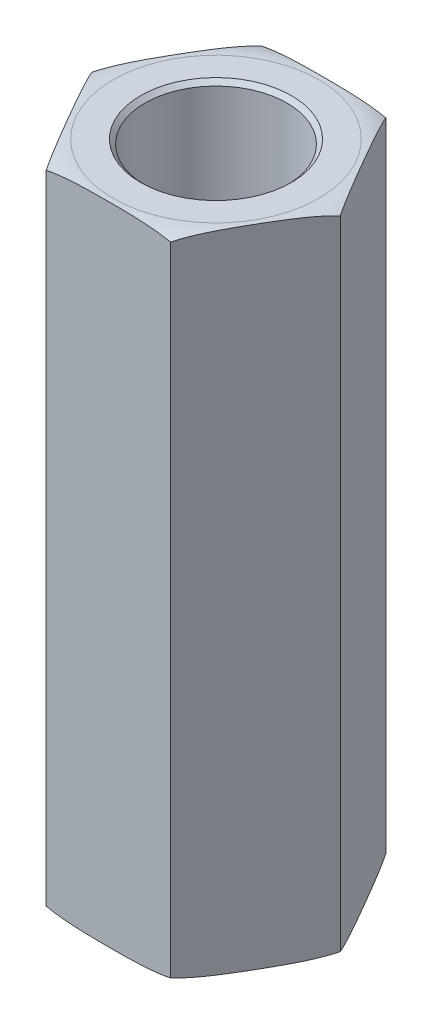
ISO-10303-21;
HEADER;
FILE_DESCRIPTION(('STEP AP214'),'2;1');
FILE_NAME('part.step','',(''),(''),'','','');
FILE_SCHEMA(('AUTOMOTIVE_DESIGN { 1 0 10303 214 1 1 1 1 }'));
ENDSEC;
DATA;
#1=APPLICATION_CONTEXT('core data for automotive mechanical design processes');
#2=APPLICATION_PROTOCOL_DEFINITION('international standard','automotive_design',2000,#1);
#3=PRODUCT_CONTEXT('',#1,'mechanical');
#4=PRODUCT('Part','Part','',(#3));
#5=PRODUCT_RELATED_PRODUCT_CATEGORY('part','',(#4));
#6=PRODUCT_DEFINITION_FORMATION('','',#4);
#7=PRODUCT_DEFINITION_CONTEXT('part definition',#1,'design');
#8=PRODUCT_DEFINITION('design','',#6,#7);
#9=PRODUCT_DEFINITION_SHAPE('','',#8);
#10=(LENGTH_UNIT() NAMED_UNIT(*) SI_UNIT(.MILLI.,.METRE.));
#11=(NAMED_UNIT(*) PLANE_ANGLE_UNIT() SI_UNIT($,.RADIAN.));
#12=(NAMED_UNIT(*) SI_UNIT($,.STERADIAN.) SOLID_ANGLE_UNIT());
#13=UNCERTAINTY_MEASURE_WITH_UNIT(LENGTH_MEASURE(1.E-05),#10,'distance_accuracy_value','');
#14=(GEOMETRIC_REPRESENTATION_CONTEXT(3) GLOBAL_UNCERTAINTY_ASSIGNED_CONTEXT((#13)) GLOBAL_UNIT_ASSIGNED_CONTEXT((#10,
#11,#12)) REPRESENTATION_CONTEXT('',''));
#15=CARTESIAN_POINT('',(0.,0.,0.));
#16=DIRECTION('',(0.,0.,1.));
#17=DIRECTION('',(1.,0.,0.));
#18=AXIS2_PLACEMENT_3D('',#15,#16,#17);
#19=CARTESIAN_POINT('',(3.66617420935412,9.525,0.));
#20=DIRECTION('',(-0.866025403784439,0.,0.5));
#21=DIRECTION('',(0.5,0.,0.866025403784439));
#22=AXIS2_PLACEMENT_3D('',#19,#20,#21);
#23=PLANE('',#22);
#24=DIRECTION('',(0.,1.,0.));
#25=VECTOR('',#24,1.);
#26=CARTESIAN_POINT('',(1.83308710467705,9.525,-3.175));
#27=LINE('',#26,#25);
#28=CARTESIAN_POINT('',(1.83308710467705,-9.398,-3.175));
#29=VERTEX_POINT('',#28);
#30=CARTESIAN_POINT('',(1.83308710467706,9.398,-3.175));
#31=VERTEX_POINT('',#30);
#32=EDGE_CURVE('E142',#29,#31,#27,.T.);
#33=ORIENTED_EDGE('',*,*,#32,.T.);
#34=CARTESIAN_POINT('',(3.66617420935412,9.398,0.));
#35=CARTESIAN_POINT('',(3.62797961467395,9.41390141489969,-0.0661549785605542));
#36=CARTESIAN_POINT('',(3.58956810864157,9.4274886076105,-0.132685658603869));
#37=CARTESIAN_POINT('',(3.51249051795711,9.45081619794021,-0.266187961794349));
#38=CARTESIAN_POINT('',(3.47382473049847,9.46056047713974,-0.333159070187379));
#39=CARTESIAN_POINT('',(3.39641631867874,9.4769966530451,-0.467234372392366));
#40=CARTESIAN_POINT('',(3.35767399633313,9.48369453286691,-0.534338043098168));
#41=CARTESIAN_POINT('',(3.28009834620114,9.4947767572932,-0.668703010556962));
#42=CARTESIAN_POINT('',(3.24126499587772,9.49916045047396,-0.735964346345247));
#43=CARTESIAN_POINT('',(3.16354065964316,9.50624030042628,-0.870586845688074));
#44=CARTESIAN_POINT('',(3.12464965374477,9.50893552375912,-0.937948043861543));
#45=CARTESIAN_POINT('',(3.04685144594594,9.51315319837134,-1.07269849250692));
#46=CARTESIAN_POINT('',(3.00794424351971,9.51467560802717,-1.14008774388952));
#47=CARTESIAN_POINT('',(2.93051517598875,9.51692270588903,-1.27419882283583));
#48=CARTESIAN_POINT('',(2.89199336248936,9.51765524681809,-1.34092056101645));
#49=CARTESIAN_POINT('',(2.81494778346146,9.51857673025742,-1.47436741839135));
#50=CARTESIAN_POINT('',(2.77642401791441,9.51876566589491,-1.5410925376177));
#51=CARTESIAN_POINT('',(2.69935964431015,9.51866599668056,-1.67457194815376));
#52=CARTESIAN_POINT('',(2.66081903631824,9.51837718117656,-1.74132623935034));
#53=CARTESIAN_POINT('',(2.58373908085332,9.517221986219,-1.87483263846072));
#54=CARTESIAN_POINT('',(2.54519973341248,9.51635559703857,-1.94158474631881));
#55=CARTESIAN_POINT('',(2.46812969629774,9.51378619406564,-2.07507396634277));
#56=CARTESIAN_POINT('',(2.42959900625968,9.51208322716166,-2.14181107913937));
#57=CARTESIAN_POINT('',(2.35255651340912,9.50743872297261,-2.27525259109831));
#58=CARTESIAN_POINT('',(2.31404470975446,9.50449724713581,-2.34195699171929));
#59=CARTESIAN_POINT('',(2.25084206239948,9.49821741247489,-2.45142718811098));
#60=CARTESIAN_POINT('',(2.22613849337013,9.49539801104633,-2.4942150247981));
#61=CARTESIAN_POINT('',(2.1767694527223,9.48886967943037,-2.57972471152106));
#62=CARTESIAN_POINT('',(2.15210397034186,9.48516108091391,-2.62244658019719));
#63=CARTESIAN_POINT('',(2.10282753811698,9.4766802711497,-2.70779586442641));
#64=CARTESIAN_POINT('',(2.07821657107531,9.47190846570085,-2.75042330976598));
#65=CARTESIAN_POINT('',(2.02900094683551,9.4610987712516,-2.83566727147553));
#66=CARTESIAN_POINT('',(2.00439646085464,9.45505773130843,-2.87828349128851));
#67=CARTESIAN_POINT('',(1.95527325900934,9.44151383541612,-2.96336737271503));
#68=CARTESIAN_POINT('',(1.93075459617615,9.43401019780297,-3.00583494247578));
#69=CARTESIAN_POINT('',(1.88182157373171,9.41732035070844,-3.09058942351744));
#70=CARTESIAN_POINT('',(1.85740744053269,9.40813149780328,-3.1328759426409));
#71=CARTESIAN_POINT('',(1.83308710467706,9.398,-3.175));
#72=B_SPLINE_CURVE_WITH_KNOTS('',3,(#34,#35,#36,#37,#38,#39,#40,#41,#42,#43,#44,#45,#46,#47,#48,
#49,#50,#51,#52,#53,#54,#55,#56,#57,#58,#59,#60,#61,#62,#63,#64,#65,#66,#67,#68,#69,#70,#71),
.UNSPECIFIED.,.F.,.F.,(4,2,2,2,2,2,2,2,2,2,2,2,2,2,2,2,2,2,4),(0.,0.233977307817935,
0.467717675040681,0.70099697355748,0.934341903229723,1.16781571967236,1.40129782179821,
1.63243665809665,1.86357841666612,2.09482211846288,2.32606971471488,2.5573043514739,
2.78852751694405,2.93698369265081,3.08538458004469,3.23372892334581,3.3824459854661,
3.53124274626083,3.68027493713586),.UNSPECIFIED.);
#73=CARTESIAN_POINT('',(3.66617420935412,9.398,0.));
#74=VERTEX_POINT('',#73);
#75=EDGE_CURVE('E96',#74,#31,#72,.T.);
#76=ORIENTED_EDGE('',*,*,#75,.F.);
#77=DIRECTION('',(0.,1.,0.));
#78=VECTOR('',#77,1.);
#79=CARTESIAN_POINT('',(3.66617420935412,9.525,0.));
#80=LINE('',#79,#78);
#81=CARTESIAN_POINT('',(3.66617420935412,-9.398,0.));
#82=VERTEX_POINT('',#81);
#83=EDGE_CURVE('E144',#74,#82,#80,.F.);
#84=ORIENTED_EDGE('',*,*,#83,.T.);
#85=CARTESIAN_POINT('',(1.83308710467705,-9.398,-3.17500000000001));
#86=CARTESIAN_POINT('',(1.87128169935722,-9.41390141489968,-3.10884502143945));
#87=CARTESIAN_POINT('',(1.9096932053896,-9.4274886076105,-3.04231434139614));
#88=CARTESIAN_POINT('',(1.98677079607406,-9.4508161979402,-2.90881203820566));
#89=CARTESIAN_POINT('',(2.0254365835327,-9.46056047713973,-2.84184092981263));
#90=CARTESIAN_POINT('',(2.10284499535243,-9.47699665304509,-2.70776562760765));
#91=CARTESIAN_POINT('',(2.14158731769803,-9.48369453286691,-2.64066195690184));
#92=CARTESIAN_POINT('',(2.21916296783002,-9.49477675729319,-2.50629698944305));
#93=CARTESIAN_POINT('',(2.25799631815344,-9.49916045047396,-2.43903565365477));
#94=CARTESIAN_POINT('',(2.335720654388,-9.50624030042628,-2.30441315431194));
#95=CARTESIAN_POINT('',(2.37461166028639,-9.50893552375912,-2.23705195613848));
#96=CARTESIAN_POINT('',(2.45240986808522,-9.51315319837134,-2.10230150749311));
#97=CARTESIAN_POINT('',(2.49131707051145,-9.51467560802717,-2.0349122561105));
#98=CARTESIAN_POINT('',(2.56874613804241,-9.51692270588903,-1.9008011771642));
#99=CARTESIAN_POINT('',(2.6072679515418,-9.51765524681809,-1.83407943898357));
#100=CARTESIAN_POINT('',(2.6843135305697,-9.51857673025742,-1.70063258160867));
#101=CARTESIAN_POINT('',(2.72283729611674,-9.51876566589491,-1.63390746238233));
#102=CARTESIAN_POINT('',(2.79990166972101,-9.51866599668056,-1.50042805184627));
#103=CARTESIAN_POINT('',(2.83844227771292,-9.51837718117656,-1.43367376064969));
#104=CARTESIAN_POINT('',(2.91552223317783,-9.517221986219,-1.30016736153931));
#105=CARTESIAN_POINT('',(2.95406158061867,-9.51635559703857,-1.23341525368122));
#106=CARTESIAN_POINT('',(3.03113161773342,-9.51378619406564,-1.09992603365727));
#107=CARTESIAN_POINT('',(3.06966230777147,-9.51208322716166,-1.03318892086067));
#108=CARTESIAN_POINT('',(3.14670480062203,-9.50743872297261,-0.899747408901733));
#109=CARTESIAN_POINT('',(3.18521660427669,-9.50449724713582,-0.83304300828075));
#110=CARTESIAN_POINT('',(3.24841925163167,-9.49821741247489,-0.723572811889063));
#111=CARTESIAN_POINT('',(3.27312282066102,-9.49539801104633,-0.680784975201942));
#112=CARTESIAN_POINT('',(3.32249186130885,-9.48886967943037,-0.595275288478971));
#113=CARTESIAN_POINT('',(3.3471573436893,-9.48516108091391,-0.552553419802841));
#114=CARTESIAN_POINT('',(3.39643377591418,-9.4766802711497,-0.46720413557362));
#115=CARTESIAN_POINT('',(3.42104474295585,-9.47190846570085,-0.424576690234039));
#116=CARTESIAN_POINT('',(3.47026036719565,-9.4610987712516,-0.339332728524487));
#117=CARTESIAN_POINT('',(3.49486485317652,-9.45505773130843,-0.296716508711511));
#118=CARTESIAN_POINT('',(3.54398805502183,-9.44151383541613,-0.211632627284978));
#119=CARTESIAN_POINT('',(3.56850671785502,-9.43401019780297,-0.169165057524231));
#120=CARTESIAN_POINT('',(3.61743974029946,-9.41732035070845,-0.08441057648256));
#121=CARTESIAN_POINT('',(3.64185387349848,-9.40813149780329,-0.0421240573591054));
#122=CARTESIAN_POINT('',(3.66617420935412,-9.398,0.));
#123=B_SPLINE_CURVE_WITH_KNOTS('',3,(#85,#86,#87,#88,#89,#90,#91,#92,#93,#94,#95,#96,#97,#98,
#99,#100,#101,#102,#103,#104,#105,#106,#107,#108,#109,#110,#111,#112,#113,#114,#115,#116,#117,
#118,#119,#120,#121,#122),.UNSPECIFIED.,.F.,.F.,(4,2,2,2,2,2,2,2,2,2,2,2,2,2,2,2,2,2,4),(0.,
0.233977307817932,0.467717675040674,0.700996973557469,0.934341903229708,1.16781571967234,
1.40129782179818,1.63243665809662,1.86357841666608,2.09482211846285,2.32606971471484,
2.55730435147386,2.78852751694401,2.93698369265077,3.08538458004466,3.23372892334579,
3.38244598546609,3.53124274626083,3.68027493713586),.UNSPECIFIED.);
#124=EDGE_CURVE('E220',#29,#82,#123,.T.);
#125=ORIENTED_EDGE('',*,*,#124,.F.);
#126=EDGE_LOOP('',(#33,#76,#84,#125));
#127=FACE_BOUND('',#126,.T.);
#128=ADVANCED_FACE('F16',(#127),#23,.F.);
#129=CARTESIAN_POINT('',(1.83308710467706,9.525,3.17499999999999));
#130=DIRECTION('',(-0.866025403784439,0.,-0.5));
#131=DIRECTION('',(-0.5,0.,0.866025403784439));
#132=AXIS2_PLACEMENT_3D('',#129,#130,#131);
#133=PLANE('',#132);
#134=ORIENTED_EDGE('',*,*,#83,.F.);
#135=CARTESIAN_POINT('',(1.83308710467706,9.398,3.17499999999999));
#136=CARTESIAN_POINT('',(1.87128169935724,9.41390141489969,3.10884502143943));
#137=CARTESIAN_POINT('',(1.90969320538961,9.4274886076105,3.04231434139612));
#138=CARTESIAN_POINT('',(1.98677079607407,9.45081619794021,2.90881203820564));
#139=CARTESIAN_POINT('',(2.02543658353271,9.46056047713974,2.84184092981261));
#140=CARTESIAN_POINT('',(2.10284499535245,9.4769966530451,2.70776562760762));
#141=CARTESIAN_POINT('',(2.14158731769805,9.48369453286691,2.64066195690182));
#142=CARTESIAN_POINT('',(2.21916296783004,9.4947767572932,2.50629698944302));
#143=CARTESIAN_POINT('',(2.25799631815346,9.49916045047396,2.43903565365474));
#144=CARTESIAN_POINT('',(2.33572065438802,9.50624030042628,2.30441315431191));
#145=CARTESIAN_POINT('',(2.37461166028641,9.50893552375912,2.23705195613844));
#146=CARTESIAN_POINT('',(2.45240986808524,9.51315319837134,2.10230150749307));
#147=CARTESIAN_POINT('',(2.49131707051148,9.51467560802717,2.03491225611046));
#148=CARTESIAN_POINT('',(2.56874613804244,9.51692270588903,1.90080117716416));
#149=CARTESIAN_POINT('',(2.60726795154182,9.51765524681809,1.83407943898353));
#150=CARTESIAN_POINT('',(2.68431353056973,9.51857673025742,1.70063258160863));
#151=CARTESIAN_POINT('',(2.72283729611677,9.51876566589491,1.63390746238228));
#152=CARTESIAN_POINT('',(2.79990166972104,9.51866599668056,1.50042805184622));
#153=CARTESIAN_POINT('',(2.83844227771295,9.51837718117656,1.43367376064964));
#154=CARTESIAN_POINT('',(2.91552223317786,9.517221986219,1.30016736153926));
#155=CARTESIAN_POINT('',(2.95406158061871,9.51635559703857,1.23341525368117));
#156=CARTESIAN_POINT('',(3.03113161773345,9.51378619406564,1.09992603365721));
#157=CARTESIAN_POINT('',(3.06966230777151,9.51208322716166,1.03318892086061));
#158=CARTESIAN_POINT('',(3.14670480062207,9.50743872297261,0.899747408901672));
#159=CARTESIAN_POINT('',(3.18521660427673,9.50449724713581,0.833043008280688));
#160=CARTESIAN_POINT('',(3.24841925163171,9.49821741247489,0.723572811889004));
#161=CARTESIAN_POINT('',(3.27312282066106,9.49539801104633,0.680784975201887));
#162=CARTESIAN_POINT('',(3.32249186130888,9.48886967943037,0.595275288478923));
#163=CARTESIAN_POINT('',(3.34715734368933,9.48516108091391,0.552553419802797));
#164=CARTESIAN_POINT('',(3.3964337759142,9.4766802711497,0.467204135573584));
#165=CARTESIAN_POINT('',(3.42104474295588,9.47190846570085,0.424576690234007));
#166=CARTESIAN_POINT('',(3.47026036719567,9.4610987712516,0.339332728524462));
#167=CARTESIAN_POINT('',(3.49486485317654,9.45505773130843,0.296716508711489));
#168=CARTESIAN_POINT('',(3.54398805502184,9.44151383541612,0.211632627284964));
#169=CARTESIAN_POINT('',(3.56850671785503,9.43401019780297,0.169165057524221));
#170=CARTESIAN_POINT('',(3.61743974029946,9.41732035070844,0.0844105764825579));
#171=CARTESIAN_POINT('',(3.64185387349848,9.40813149780328,0.042124057359107));
#172=CARTESIAN_POINT('',(3.66617420935412,9.398,0.));
#173=B_SPLINE_CURVE_WITH_KNOTS('',3,(#135,#136,#137,#138,#139,#140,#141,#142,#143,#144,#145,
#146,#147,#148,#149,#150,#151,#152,#153,#154,#155,#156,#157,#158,#159,#160,#161,#162,#163,#164,
#165,#166,#167,#168,#169,#170,#171,#172),.UNSPECIFIED.,.F.,.F.,(4,2,2,2,2,2,2,2,2,2,2,2,2,2,2,2,
2,2,4),(0.,0.233977307817936,0.467717675040682,0.700996973557482,0.934341903229727,
1.16781571967237,1.40129782179821,1.63243665809666,1.86357841666612,2.09482211846289,
2.32606971471489,2.55730435147391,2.78852751694406,2.93698369265081,3.08538458004469,
3.23372892334581,3.3824459854661,3.53124274626082,3.68027493713584),.UNSPECIFIED.);
#174=CARTESIAN_POINT('',(1.83308710467707,9.398,3.17499999999999));
#175=VERTEX_POINT('',#174);
#176=EDGE_CURVE('E213',#175,#74,#173,.T.);
#177=ORIENTED_EDGE('',*,*,#176,.F.);
#178=DIRECTION('',(0.,1.,0.));
#179=VECTOR('',#178,1.);
#180=CARTESIAN_POINT('',(1.83308710467707,9.525,3.17499999999999));
#181=LINE('',#180,#179);
#182=CARTESIAN_POINT('',(1.83308710467706,-9.398,3.17499999999999));
#183=VERTEX_POINT('',#182);
#184=EDGE_CURVE('E139',#175,#183,#181,.F.);
#185=ORIENTED_EDGE('',*,*,#184,.T.);
#186=CARTESIAN_POINT('',(3.66617420935412,-9.398,0.));
#187=CARTESIAN_POINT('',(3.62797961467395,-9.41390141489969,0.0661549785605599));
#188=CARTESIAN_POINT('',(3.58956810864157,-9.4274886076105,0.132685658603875));
#189=CARTESIAN_POINT('',(3.51249051795711,-9.45081619794021,0.266187961794355));
#190=CARTESIAN_POINT('',(3.47382473049847,-9.46056047713974,0.333159070187385));
#191=CARTESIAN_POINT('',(3.39641631867874,-9.4769966530451,0.467234372392373));
#192=CARTESIAN_POINT('',(3.35767399633313,-9.48369453286691,0.534338043098174));
#193=CARTESIAN_POINT('',(3.28009834620114,-9.4947767572932,0.668703010556968));
#194=CARTESIAN_POINT('',(3.24126499587772,-9.49916045047396,0.735964346345254));
#195=CARTESIAN_POINT('',(3.16354065964316,-9.50624030042628,0.87058684568808));
#196=CARTESIAN_POINT('',(3.12464965374477,-9.50893552375912,0.93794804386155));
#197=CARTESIAN_POINT('',(3.04685144594594,-9.51315319837134,1.07269849250692));
#198=CARTESIAN_POINT('',(3.00794424351971,-9.51467560802717,1.14008774388953));
#199=CARTESIAN_POINT('',(2.93051517598875,-9.51692270588903,1.27419882283583));
#200=CARTESIAN_POINT('',(2.89199336248936,-9.51765524681809,1.34092056101646));
#201=CARTESIAN_POINT('',(2.81494778346145,-9.51857673025742,1.47436741839136));
#202=CARTESIAN_POINT('',(2.77642401791441,-9.51876566589491,1.54109253761771));
#203=CARTESIAN_POINT('',(2.69935964431015,-9.51866599668056,1.67457194815377));
#204=CARTESIAN_POINT('',(2.66081903631824,-9.51837718117656,1.74132623935035));
#205=CARTESIAN_POINT('',(2.58373908085332,-9.517221986219,1.87483263846073));
#206=CARTESIAN_POINT('',(2.54519973341248,-9.51635559703857,1.94158474631882));
#207=CARTESIAN_POINT('',(2.46812969629773,-9.51378619406564,2.07507396634278));
#208=CARTESIAN_POINT('',(2.42959900625968,-9.51208322716166,2.14181107913938));
#209=CARTESIAN_POINT('',(2.35255651340911,-9.50743872297261,2.27525259109832));
#210=CARTESIAN_POINT('',(2.31404470975446,-9.50449724713581,2.3419569917193));
#211=CARTESIAN_POINT('',(2.25084206239948,-9.49821741247489,2.45142718811099));
#212=CARTESIAN_POINT('',(2.22613849337013,-9.49539801104633,2.4942150247981));
#213=CARTESIAN_POINT('',(2.1767694527223,-9.48886967943037,2.57972471152107));
#214=CARTESIAN_POINT('',(2.15210397034186,-9.48516108091391,2.62244658019719));
#215=CARTESIAN_POINT('',(2.10282753811698,-9.4766802711497,2.70779586442641));
#216=CARTESIAN_POINT('',(2.07821657107531,-9.47190846570085,2.75042330976598));
#217=CARTESIAN_POINT('',(2.02900094683551,-9.4610987712516,2.83566727147553));
#218=CARTESIAN_POINT('',(2.00439646085465,-9.45505773130843,2.8782834912885));
#219=CARTESIAN_POINT('',(1.95527325900934,-9.44151383541612,2.96336737271503));
#220=CARTESIAN_POINT('',(1.93075459617615,-9.43401019780296,3.00583494247577));
#221=CARTESIAN_POINT('',(1.88182157373172,-9.41732035070844,3.09058942351744));
#222=CARTESIAN_POINT('',(1.8574074405327,-9.40813149780329,3.13287594264089));
#223=CARTESIAN_POINT('',(1.83308710467706,-9.398,3.17499999999999));
#224=B_SPLINE_CURVE_WITH_KNOTS('',3,(#186,#187,#188,#189,#190,#191,#192,#193,#194,#195,#196,
#197,#198,#199,#200,#201,#202,#203,#204,#205,#206,#207,#208,#209,#210,#211,#212,#213,#214,#215,
#216,#217,#218,#219,#220,#221,#222,#223),.UNSPECIFIED.,.F.,.F.,(4,2,2,2,2,2,2,2,2,2,2,2,2,2,2,2,
2,2,4),(0.,0.233977307817936,0.467717675040682,0.700996973557481,0.934341903229725,
1.16781571967236,1.40129782179821,1.63243665809665,1.86357841666612,2.09482211846289,
2.32606971471488,2.55730435147391,2.78852751694405,2.93698369265081,3.08538458004468,
3.2337289233458,3.38244598546609,3.53124274626082,3.68027493713584),.UNSPECIFIED.);
#225=EDGE_CURVE('E239',#82,#183,#224,.T.);
#226=ORIENTED_EDGE('',*,*,#225,.F.);
#227=EDGE_LOOP('',(#134,#177,#185,#226));
#228=FACE_BOUND('',#227,.T.);
#229=ADVANCED_FACE('F217',(#228),#133,.F.);
#230=CARTESIAN_POINT('',(1.83308710467706,9.525,-3.175));
#231=DIRECTION('',(0.,0.,1.));
#232=DIRECTION('',(1.,0.,0.));
#233=AXIS2_PLACEMENT_3D('',#230,#231,#232);
#234=PLANE('',#233);
#235=DIRECTION('',(0.,1.,0.));
#236=VECTOR('',#235,1.);
#237=CARTESIAN_POINT('',(-1.83308710467707,9.525,-3.175));
#238=LINE('',#237,#236);
#239=CARTESIAN_POINT('',(-1.83308710467707,-9.39799999999999,-3.175));
#240=VERTEX_POINT('',#239);
#241=CARTESIAN_POINT('',(-1.83308710467706,9.398,-3.17500000000001));
#242=VERTEX_POINT('',#241);
#243=EDGE_CURVE('E103',#240,#242,#238,.T.);
#244=ORIENTED_EDGE('',*,*,#243,.T.);
#245=CARTESIAN_POINT('',(1.83308710467706,9.398,-3.175));
#246=CARTESIAN_POINT('',(1.73237579828683,9.41894001415179,-3.175));
#247=CARTESIAN_POINT('',(1.63096506893486,9.43588534953273,-3.175));
#248=CARTESIAN_POINT('',(1.42767146651469,9.46349716439842,-3.175));
#249=CARTESIAN_POINT('',(1.32579191427254,9.47418756587531,-3.175));
#250=CARTESIAN_POINT('',(1.12177634709137,9.49112804080793,-3.175));
#251=CARTESIAN_POINT('',(1.0196405664338,9.49738127071887,-3.175));
#252=CARTESIAN_POINT('',(0.815663681397375,9.50690280641833,-3.175));
#253=CARTESIAN_POINT('',(0.713823115514573,9.5101834044999,-3.175));
#254=CARTESIAN_POINT('',(0.510018485441651,9.51494548487028,-3.175));
#255=CARTESIAN_POINT('',(0.408054390577976,9.51642541008817,-3.175));
#256=CARTESIAN_POINT('',(0.20406020033787,9.51831468183793,-3.175));
#257=CARTESIAN_POINT('',(0.102030100168935,9.51872342414921,-3.175));
#258=CARTESIAN_POINT('',(-0.102030100168934,9.51872342414921,-3.175));
#259=CARTESIAN_POINT('',(-0.204060200337869,9.51831468183793,-3.175));
#260=CARTESIAN_POINT('',(-0.408054390577975,9.51642541008817,-3.175));
#261=CARTESIAN_POINT('',(-0.510018485441649,9.51494548487028,-3.175));
#262=CARTESIAN_POINT('',(-0.713823115514571,9.5101834044999,-3.175));
#263=CARTESIAN_POINT('',(-0.815663681397373,9.50690280641833,-3.175));
#264=CARTESIAN_POINT('',(-1.01964056643379,9.49738127071887,-3.175));
#265=CARTESIAN_POINT('',(-1.12177634709137,9.49112804080793,-3.175));
#266=CARTESIAN_POINT('',(-1.32579191427253,9.47418756587531,-3.175));
#267=CARTESIAN_POINT('',(-1.42767146651469,9.46349716439842,-3.175));
#268=CARTESIAN_POINT('',(-1.63096506893485,9.43588534953273,-3.175));
#269=CARTESIAN_POINT('',(-1.73237579828683,9.41894001415179,-3.175));
#270=CARTESIAN_POINT('',(-1.83308710467705,9.398,-3.17500000000001));
#271=B_SPLINE_CURVE_WITH_KNOTS('',3,(#245,#246,#247,#248,#249,#250,#251,#252,#253,#254,#255,
#256,#257,#258,#259,#260,#261,#262,#263,#264,#265,#266,#267,#268,#269,#270),.UNSPECIFIED.,.F.,
.F.,(4,2,2,2,2,2,2,2,2,2,2,2,4),(0.,0.308333242342807,0.615479423308234,0.922406891130008,
1.2280592962085,1.53397581645216,1.84006485747889,2.14615389850561,2.45207041874927,
2.75772282382776,3.06465029164954,3.37179647261496,3.68012971495777),.UNSPECIFIED.);
#272=EDGE_CURVE('E88',#31,#242,#271,.T.);
#273=ORIENTED_EDGE('',*,*,#272,.F.);
#274=ORIENTED_EDGE('',*,*,#32,.F.);
#275=CARTESIAN_POINT('',(-1.83308710467707,-9.39799999999999,-3.175));
#276=CARTESIAN_POINT('',(-1.73237579828684,-9.41894001415179,-3.175));
#277=CARTESIAN_POINT('',(-1.63096506893487,-9.43588534953273,-3.175));
#278=CARTESIAN_POINT('',(-1.4276714665147,-9.46349716439842,-3.175));
#279=CARTESIAN_POINT('',(-1.32579191427255,-9.47418756587531,-3.175));
#280=CARTESIAN_POINT('',(-1.12177634709138,-9.49112804080793,-3.175));
#281=CARTESIAN_POINT('',(-1.0196405664338,-9.49738127071887,-3.175));
#282=CARTESIAN_POINT('',(-0.81566368139738,-9.50690280641833,-3.175));
#283=CARTESIAN_POINT('',(-0.713823115514577,-9.5101834044999,-3.175));
#284=CARTESIAN_POINT('',(-0.510018485441654,-9.51494548487028,-3.175));
#285=CARTESIAN_POINT('',(-0.408054390577979,-9.51642541008817,-3.175));
#286=CARTESIAN_POINT('',(-0.204060200337872,-9.51831468183793,-3.175));
#287=CARTESIAN_POINT('',(-0.102030100168936,-9.51872342414921,-3.175));
#288=CARTESIAN_POINT('',(0.102030100168934,-9.51872342414921,-3.175));
#289=CARTESIAN_POINT('',(0.204060200337869,-9.51831468183793,-3.175));
#290=CARTESIAN_POINT('',(0.408054390577974,-9.51642541008817,-3.175));
#291=CARTESIAN_POINT('',(0.510018485441648,-9.51494548487028,-3.175));
#292=CARTESIAN_POINT('',(0.713823115514568,-9.5101834044999,-3.175));
#293=CARTESIAN_POINT('',(0.81566368139737,-9.50690280641833,-3.175));
#294=CARTESIAN_POINT('',(1.01964056643379,-9.49738127071887,-3.175));
#295=CARTESIAN_POINT('',(1.12177634709137,-9.49112804080794,-3.175));
#296=CARTESIAN_POINT('',(1.32579191427253,-9.47418756587531,-3.175));
#297=CARTESIAN_POINT('',(1.42767146651468,-9.46349716439843,-3.175));
#298=CARTESIAN_POINT('',(1.63096506893485,-9.43588534953273,-3.175));
#299=CARTESIAN_POINT('',(1.73237579828682,-9.41894001415179,-3.175));
#300=CARTESIAN_POINT('',(1.83308710467705,-9.398,-3.175));
#301=B_SPLINE_CURVE_WITH_KNOTS('',3,(#275,#276,#277,#278,#279,#280,#281,#282,#283,#284,#285,
#286,#287,#288,#289,#290,#291,#292,#293,#294,#295,#296,#297,#298,#299,#300),.UNSPECIFIED.,.F.,
.F.,(4,2,2,2,2,2,2,2,2,2,2,2,4),(0.,0.308333242342809,0.615479423308238,0.922406891130013,
1.22805929620851,1.53397581645217,1.8400648574789,2.14615389850562,2.45207041874928,
2.75772282382777,3.06465029164954,3.37179647261497,3.68012971495777),.UNSPECIFIED.);
#302=EDGE_CURVE('E105',#240,#29,#301,.T.);
#303=ORIENTED_EDGE('',*,*,#302,.F.);
#304=EDGE_LOOP('',(#244,#273,#274,#303));
#305=FACE_BOUND('',#304,.T.);
#306=ADVANCED_FACE('F104',(#305),#234,.F.);
#307=CARTESIAN_POINT('',(-1.83308710467707,9.525,3.175));
#308=DIRECTION('',(0.,0.,-1.));
#309=DIRECTION('',(-1.,0.,0.));
#310=AXIS2_PLACEMENT_3D('',#307,#308,#309);
#311=PLANE('',#310);
#312=ORIENTED_EDGE('',*,*,#184,.F.);
#313=CARTESIAN_POINT('',(-1.83308710467706,9.398,3.175));
#314=CARTESIAN_POINT('',(-1.73237579828684,9.41894001415179,3.175));
#315=CARTESIAN_POINT('',(-1.63096506893486,9.43588534953273,3.175));
#316=CARTESIAN_POINT('',(-1.42767146651469,9.46349716439843,3.175));
#317=CARTESIAN_POINT('',(-1.32579191427254,9.47418756587531,3.175));
#318=CARTESIAN_POINT('',(-1.12177634709138,9.49112804080793,3.175));
#319=CARTESIAN_POINT('',(-1.0196405664338,9.49738127071888,3.175));
#320=CARTESIAN_POINT('',(-0.815663681397378,9.50690280641833,3.175));
#321=CARTESIAN_POINT('',(-0.713823115514575,9.5101834044999,3.175));
#322=CARTESIAN_POINT('',(-0.510018485441652,9.51494548487029,3.175));
#323=CARTESIAN_POINT('',(-0.408054390577978,9.51642541008817,3.175));
#324=CARTESIAN_POINT('',(-0.204060200337871,9.51831468183793,3.175));
#325=CARTESIAN_POINT('',(-0.102030100168935,9.51872342414921,3.17499999999999));
#326=CARTESIAN_POINT('',(0.102030100168936,9.51872342414921,3.17499999999999));
#327=CARTESIAN_POINT('',(0.204060200337871,9.51831468183793,3.17499999999999));
#328=CARTESIAN_POINT('',(0.408054390577978,9.51642541008817,3.17499999999999));
#329=CARTESIAN_POINT('',(0.510018485441653,9.51494548487029,3.17499999999999));
#330=CARTESIAN_POINT('',(0.713823115514576,9.5101834044999,3.17499999999999));
#331=CARTESIAN_POINT('',(0.815663681397379,9.50690280641833,3.17499999999999));
#332=CARTESIAN_POINT('',(1.0196405664338,9.49738127071888,3.17499999999999));
#333=CARTESIAN_POINT('',(1.12177634709138,9.49112804080794,3.17499999999999));
#334=CARTESIAN_POINT('',(1.32579191427254,9.47418756587531,3.17499999999999));
#335=CARTESIAN_POINT('',(1.4276714665147,9.46349716439843,3.17499999999999));
#336=CARTESIAN_POINT('',(1.63096506893486,9.43588534953273,3.17499999999999));
#337=CARTESIAN_POINT('',(1.73237579828684,9.41894001415179,3.17499999999999));
#338=CARTESIAN_POINT('',(1.83308710467707,9.398,3.17499999999999));
#339=B_SPLINE_CURVE_WITH_KNOTS('',3,(#313,#314,#315,#316,#317,#318,#319,#320,#321,#322,#323,
#324,#325,#326,#327,#328,#329,#330,#331,#332,#333,#334,#335,#336,#337,#338),.UNSPECIFIED.,.F.,
.F.,(4,2,2,2,2,2,2,2,2,2,2,2,4),(0.,0.308333242342809,0.615479423308237,0.922406891130012,
1.2280592962085,1.53397581645216,1.84006485747889,2.14615389850562,2.45207041874928,
2.75772282382778,3.06465029164955,3.37179647261498,3.68012971495779),.UNSPECIFIED.);
#340=CARTESIAN_POINT('',(-1.83308710467707,9.398,3.175));
#341=VERTEX_POINT('',#340);
#342=EDGE_CURVE('E99',#341,#175,#339,.T.);
#343=ORIENTED_EDGE('',*,*,#342,.F.);
#344=DIRECTION('',(0.,1.,0.));
#345=VECTOR('',#344,1.);
#346=CARTESIAN_POINT('',(-1.83308710467707,9.525,3.175));
#347=LINE('',#346,#345);
#348=CARTESIAN_POINT('',(-1.83308710467706,-9.398,3.175));
#349=VERTEX_POINT('',#348);
#350=EDGE_CURVE('E107',#341,#349,#347,.F.);
#351=ORIENTED_EDGE('',*,*,#350,.T.);
#352=CARTESIAN_POINT('',(1.83308710467706,-9.398,3.17499999999999));
#353=CARTESIAN_POINT('',(1.73237579828684,-9.41894001415179,3.17499999999999));
#354=CARTESIAN_POINT('',(1.63096506893486,-9.43588534953273,3.17499999999999));
#355=CARTESIAN_POINT('',(1.4276714665147,-9.46349716439843,3.17499999999999));
#356=CARTESIAN_POINT('',(1.32579191427254,-9.47418756587531,3.17499999999999));
#357=CARTESIAN_POINT('',(1.12177634709138,-9.49112804080793,3.17499999999999));
#358=CARTESIAN_POINT('',(1.0196405664338,-9.49738127071888,3.17499999999999));
#359=CARTESIAN_POINT('',(0.815663681397379,-9.50690280641833,3.17499999999999));
#360=CARTESIAN_POINT('',(0.713823115514576,-9.5101834044999,3.17499999999999));
#361=CARTESIAN_POINT('',(0.510018485441653,-9.51494548487029,3.17499999999999));
#362=CARTESIAN_POINT('',(0.408054390577978,-9.51642541008817,3.17499999999999));
#363=CARTESIAN_POINT('',(0.204060200337871,-9.51831468183793,3.17499999999999));
#364=CARTESIAN_POINT('',(0.102030100168935,-9.51872342414921,3.17499999999999));
#365=CARTESIAN_POINT('',(-0.102030100168935,-9.51872342414921,3.17499999999999));
#366=CARTESIAN_POINT('',(-0.204060200337871,-9.51831468183793,3.175));
#367=CARTESIAN_POINT('',(-0.408054390577977,-9.51642541008817,3.175));
#368=CARTESIAN_POINT('',(-0.510018485441652,-9.51494548487029,3.175));
#369=CARTESIAN_POINT('',(-0.713823115514575,-9.5101834044999,3.175));
#370=CARTESIAN_POINT('',(-0.815663681397378,-9.50690280641833,3.175));
#371=CARTESIAN_POINT('',(-1.0196405664338,-9.49738127071888,3.175));
#372=CARTESIAN_POINT('',(-1.12177634709138,-9.49112804080793,3.175));
#373=CARTESIAN_POINT('',(-1.32579191427254,-9.47418756587531,3.175));
#374=CARTESIAN_POINT('',(-1.42767146651469,-9.46349716439843,3.175));
#375=CARTESIAN_POINT('',(-1.63096506893486,-9.43588534953273,3.175));
#376=CARTESIAN_POINT('',(-1.73237579828684,-9.41894001415179,3.175));
#377=CARTESIAN_POINT('',(-1.83308710467706,-9.398,3.175));
#378=B_SPLINE_CURVE_WITH_KNOTS('',3,(#352,#353,#354,#355,#356,#357,#358,#359,#360,#361,#362,
#363,#364,#365,#366,#367,#368,#369,#370,#371,#372,#373,#374,#375,#376,#377),.UNSPECIFIED.,.F.,
.F.,(4,2,2,2,2,2,2,2,2,2,2,2,4),(0.,0.308333242342809,0.615479423308237,0.922406891130013,
1.22805929620851,1.53397581645217,1.84006485747889,2.14615389850562,2.45207041874928,
2.75772282382778,3.06465029164955,3.37179647261498,3.68012971495779),.UNSPECIFIED.);
#379=EDGE_CURVE('E207',#183,#349,#378,.T.);
#380=ORIENTED_EDGE('',*,*,#379,.F.);
#381=EDGE_LOOP('',(#312,#343,#351,#380));
#382=FACE_BOUND('',#381,.T.);
#383=ADVANCED_FACE('F370',(#382),#311,.F.);
#384=CARTESIAN_POINT('',(-3.66617420935413,9.525,0.));
#385=DIRECTION('',(0.866025403784439,0.,-0.499999999999999));
#386=DIRECTION('',(-0.499999999999999,0.,-0.866025403784439));
#387=AXIS2_PLACEMENT_3D('',#384,#385,#386);
#388=PLANE('',#387);
#389=ORIENTED_EDGE('',*,*,#350,.F.);
#390=CARTESIAN_POINT('',(-3.66617420935412,9.398,0.));
#391=CARTESIAN_POINT('',(-3.62797961467395,9.41390141489969,0.0661549785605627));
#392=CARTESIAN_POINT('',(-3.58956810864157,9.4274886076105,0.132685658603878));
#393=CARTESIAN_POINT('',(-3.51249051795711,9.4508161979402,0.266187961794359));
#394=CARTESIAN_POINT('',(-3.47382473049847,9.46056047713974,0.333159070187389));
#395=CARTESIAN_POINT('',(-3.39641631867874,9.47699665304509,0.467234372392377));
#396=CARTESIAN_POINT('',(-3.35767399633313,9.48369453286691,0.534338043098178));
#397=CARTESIAN_POINT('',(-3.28009834620114,9.49477675729319,0.668703010556972));
#398=CARTESIAN_POINT('',(-3.24126499587772,9.49916045047396,0.735964346345258));
#399=CARTESIAN_POINT('',(-3.16354065964316,9.50624030042628,0.870586845688085));
#400=CARTESIAN_POINT('',(-3.12464965374477,9.50893552375912,0.937948043861555));
#401=CARTESIAN_POINT('',(-3.04685144594594,9.51315319837134,1.07269849250693));
#402=CARTESIAN_POINT('',(-3.00794424351971,9.51467560802717,1.14008774388953));
#403=CARTESIAN_POINT('',(-2.93051517598875,9.51692270588903,1.27419882283584));
#404=CARTESIAN_POINT('',(-2.89199336248936,9.51765524681809,1.34092056101647));
#405=CARTESIAN_POINT('',(-2.81494778346146,9.51857673025742,1.47436741839137));
#406=CARTESIAN_POINT('',(-2.77642401791441,9.5187656658949,1.54109253761772));
#407=CARTESIAN_POINT('',(-2.69935964431015,9.51866599668056,1.67457194815378));
#408=CARTESIAN_POINT('',(-2.66081903631824,9.51837718117656,1.74132623935036));
#409=CARTESIAN_POINT('',(-2.58373908085332,9.517221986219,1.87483263846074));
#410=CARTESIAN_POINT('',(-2.54519973341248,9.51635559703857,1.94158474631883));
#411=CARTESIAN_POINT('',(-2.46812969629774,9.51378619406564,2.07507396634279));
#412=CARTESIAN_POINT('',(-2.42959900625968,9.51208322716166,2.14181107913938));
#413=CARTESIAN_POINT('',(-2.35255651340912,9.50743872297261,2.27525259109832));
#414=CARTESIAN_POINT('',(-2.31404470975446,9.50449724713581,2.34195699171931));
#415=CARTESIAN_POINT('',(-2.25084206239948,9.49821741247489,2.45142718811099));
#416=CARTESIAN_POINT('',(-2.22613849337013,9.49539801104632,2.49421502479811));
#417=CARTESIAN_POINT('',(-2.17676945272231,9.48886967943037,2.57972471152108));
#418=CARTESIAN_POINT('',(-2.15210397034186,9.48516108091391,2.6224465801972));
#419=CARTESIAN_POINT('',(-2.10282753811698,9.47668027114969,2.70779586442642));
#420=CARTESIAN_POINT('',(-2.07821657107531,9.47190846570085,2.75042330976599));
#421=CARTESIAN_POINT('',(-2.02900094683551,9.4610987712516,2.83566727147554));
#422=CARTESIAN_POINT('',(-2.00439646085465,9.45505773130842,2.87828349128851));
#423=CARTESIAN_POINT('',(-1.95527325900935,9.44151383541612,2.96336737271504));
#424=CARTESIAN_POINT('',(-1.93075459617615,9.43401019780296,3.00583494247578));
#425=CARTESIAN_POINT('',(-1.88182157373172,9.41732035070844,3.09058942351745));
#426=CARTESIAN_POINT('',(-1.8574074405327,9.40813149780328,3.1328759426409));
#427=CARTESIAN_POINT('',(-1.83308710467707,9.398,3.175));
#428=B_SPLINE_CURVE_WITH_KNOTS('',3,(#390,#391,#392,#393,#394,#395,#396,#397,#398,#399,#400,
#401,#402,#403,#404,#405,#406,#407,#408,#409,#410,#411,#412,#413,#414,#415,#416,#417,#418,#419,
#420,#421,#422,#423,#424,#425,#426,#427),.UNSPECIFIED.,.F.,.F.,(4,2,2,2,2,2,2,2,2,2,2,2,2,2,2,2,
2,2,4),(0.,0.233977307817936,0.467717675040682,0.700996973557482,0.934341903229725,
1.16781571967237,1.40129782179821,1.63243665809665,1.86357841666612,2.09482211846289,
2.32606971471489,2.55730435147391,2.78852751694406,2.93698369265081,3.08538458004469,
3.23372892334581,3.3824459854661,3.53124274626082,3.68027493713584),.UNSPECIFIED.);
#429=CARTESIAN_POINT('',(-3.66617420935413,9.398,0.));
#430=VERTEX_POINT('',#429);
#431=EDGE_CURVE('E100',#430,#341,#428,.T.);
#432=ORIENTED_EDGE('',*,*,#431,.F.);
#433=DIRECTION('',(0.,1.,0.));
#434=VECTOR('',#433,1.);
#435=CARTESIAN_POINT('',(-3.66617420935413,9.525,0.));
#436=LINE('',#435,#434);
#437=CARTESIAN_POINT('',(-3.66617420935412,-9.398,0.));
#438=VERTEX_POINT('',#437);
#439=EDGE_CURVE('E82',#430,#438,#436,.F.);
#440=ORIENTED_EDGE('',*,*,#439,.T.);
#441=CARTESIAN_POINT('',(-1.83308710467707,-9.398,3.175));
#442=CARTESIAN_POINT('',(-1.87128169935724,-9.41390141489968,3.10884502143945));
#443=CARTESIAN_POINT('',(-1.90969320538961,-9.4274886076105,3.04231434139613));
#444=CARTESIAN_POINT('',(-1.98677079607407,-9.4508161979402,2.90881203820565));
#445=CARTESIAN_POINT('',(-2.02543658353271,-9.46056047713973,2.84184092981263));
#446=CARTESIAN_POINT('',(-2.10284499535244,-9.47699665304509,2.70776562760764));
#447=CARTESIAN_POINT('',(-2.14158731769805,-9.48369453286691,2.64066195690184));
#448=CARTESIAN_POINT('',(-2.21916296783004,-9.49477675729319,2.50629698944305));
#449=CARTESIAN_POINT('',(-2.25799631815346,-9.49916045047396,2.43903565365476));
#450=CARTESIAN_POINT('',(-2.33572065438802,-9.50624030042628,2.30441315431194));
#451=CARTESIAN_POINT('',(-2.3746116602864,-9.50893552375912,2.23705195613847));
#452=CARTESIAN_POINT('',(-2.45240986808523,-9.51315319837134,2.1023015074931));
#453=CARTESIAN_POINT('',(-2.49131707051146,-9.51467560802717,2.0349122561105));
#454=CARTESIAN_POINT('',(-2.56874613804242,-9.51692270588903,1.90080117716419));
#455=CARTESIAN_POINT('',(-2.60726795154181,-9.51765524681809,1.83407943898357));
#456=CARTESIAN_POINT('',(-2.68431353056971,-9.51857673025742,1.70063258160867));
#457=CARTESIAN_POINT('',(-2.72283729611675,-9.51876566589491,1.63390746238232));
#458=CARTESIAN_POINT('',(-2.79990166972102,-9.51866599668056,1.50042805184626));
#459=CARTESIAN_POINT('',(-2.83844227771293,-9.51837718117656,1.43367376064968));
#460=CARTESIAN_POINT('',(-2.91552223317784,-9.517221986219,1.30016736153931));
#461=CARTESIAN_POINT('',(-2.95406158061869,-9.51635559703857,1.23341525368122));
#462=CARTESIAN_POINT('',(-3.03113161773343,-9.51378619406564,1.09992603365726));
#463=CARTESIAN_POINT('',(-3.06966230777148,-9.51208322716166,1.03318892086066));
#464=CARTESIAN_POINT('',(-3.14670480062204,-9.50743872297261,0.899747408901727));
#465=CARTESIAN_POINT('',(-3.1852166042767,-9.50449724713581,0.833043008280744));
#466=CARTESIAN_POINT('',(-3.24841925163168,-9.49821741247489,0.723572811889058));
#467=CARTESIAN_POINT('',(-3.27312282066103,-9.49539801104633,0.680784975201938));
#468=CARTESIAN_POINT('',(-3.32249186130886,-9.48886967943037,0.595275288478968));
#469=CARTESIAN_POINT('',(-3.34715734368931,-9.48516108091391,0.552553419802839));
#470=CARTESIAN_POINT('',(-3.39643377591419,-9.4766802711497,0.46720413557362));
#471=CARTESIAN_POINT('',(-3.42104474295586,-9.47190846570085,0.42457669023404));
#472=CARTESIAN_POINT('',(-3.47026036719566,-9.4610987712516,0.339332728524489));
#473=CARTESIAN_POINT('',(-3.49486485317653,-9.45505773130843,0.296716508711513));
#474=CARTESIAN_POINT('',(-3.54398805502183,-9.44151383541613,0.211632627284982));
#475=CARTESIAN_POINT('',(-3.56850671785503,-9.43401019780297,0.169165057524236));
#476=CARTESIAN_POINT('',(-3.61743974029946,-9.41732035070845,0.0844105764825669));
#477=CARTESIAN_POINT('',(-3.64185387349848,-9.40813149780329,0.042124057359113));
#478=CARTESIAN_POINT('',(-3.66617420935412,-9.398,0.));
#479=B_SPLINE_CURVE_WITH_KNOTS('',3,(#441,#442,#443,#444,#445,#446,#447,#448,#449,#450,#451,
#452,#453,#454,#455,#456,#457,#458,#459,#460,#461,#462,#463,#464,#465,#466,#467,#468,#469,#470,
#471,#472,#473,#474,#475,#476,#477,#478),.UNSPECIFIED.,.F.,.F.,(4,2,2,2,2,2,2,2,2,2,2,2,2,2,2,2,
2,2,4),(0.,0.233977307817931,0.467717675040673,0.700996973557468,0.934341903229707,
1.16781571967234,1.40129782179818,1.63243665809662,1.86357841666608,2.09482211846285,
2.32606971471484,2.55730435147386,2.788527516944,2.93698369265077,3.08538458004465,
3.23372892334578,3.38244598546608,3.53124274626081,3.68027493713584),.UNSPECIFIED.);
#480=EDGE_CURVE('E161',#349,#438,#479,.T.);
#481=ORIENTED_EDGE('',*,*,#480,.F.);
#482=EDGE_LOOP('',(#389,#432,#440,#481));
#483=FACE_BOUND('',#482,.T.);
#484=ADVANCED_FACE('F210',(#483),#388,.F.);
#485=CARTESIAN_POINT('',(-1.83308710467707,9.525,-3.175));
#486=DIRECTION('',(0.866025403784439,0.,0.5));
#487=DIRECTION('',(0.5,0.,-0.866025403784439));
#488=AXIS2_PLACEMENT_3D('',#485,#486,#487);
#489=PLANE('',#488);
#490=ORIENTED_EDGE('',*,*,#439,.F.);
#491=CARTESIAN_POINT('',(-1.83308710467706,9.39799999999999,-3.17500000000001));
#492=CARTESIAN_POINT('',(-1.87128169935723,9.41390141489968,-3.10884502143945));
#493=CARTESIAN_POINT('',(-1.90969320538961,9.42748860761049,-3.04231434139614));
#494=CARTESIAN_POINT('',(-1.98677079607407,9.4508161979402,-2.90881203820567));
#495=CARTESIAN_POINT('',(-2.02543658353271,9.46056047713973,-2.84184092981264));
#496=CARTESIAN_POINT('',(-2.10284499535244,9.47699665304509,-2.70776562760765));
#497=CARTESIAN_POINT('',(-2.14158731769804,9.48369453286691,-2.64066195690185));
#498=CARTESIAN_POINT('',(-2.21916296783003,9.49477675729319,-2.50629698944306));
#499=CARTESIAN_POINT('',(-2.25799631815345,9.49916045047396,-2.43903565365478));
#500=CARTESIAN_POINT('',(-2.33572065438801,9.50624030042628,-2.30441315431196));
#501=CARTESIAN_POINT('',(-2.3746116602864,9.50893552375912,-2.23705195613849));
#502=CARTESIAN_POINT('',(-2.45240986808522,9.51315319837134,-2.10230150749312));
#503=CARTESIAN_POINT('',(-2.49131707051146,9.51467560802717,-2.03491225611052));
#504=CARTESIAN_POINT('',(-2.56874613804241,9.51692270588903,-1.90080117716422));
#505=CARTESIAN_POINT('',(-2.6072679515418,9.51765524681809,-1.83407943898359));
#506=CARTESIAN_POINT('',(-2.6843135305697,9.51857673025742,-1.70063258160869));
#507=CARTESIAN_POINT('',(-2.72283729611674,9.5187656658949,-1.63390746238234));
#508=CARTESIAN_POINT('',(-2.79990166972101,9.51866599668056,-1.50042805184629));
#509=CARTESIAN_POINT('',(-2.83844227771292,9.51837718117656,-1.43367376064971));
#510=CARTESIAN_POINT('',(-2.91552223317783,9.517221986219,-1.30016736153933));
#511=CARTESIAN_POINT('',(-2.95406158061867,9.51635559703857,-1.23341525368124));
#512=CARTESIAN_POINT('',(-3.03113161773341,9.51378619406564,-1.09992603365729));
#513=CARTESIAN_POINT('',(-3.06966230777147,9.51208322716166,-1.03318892086069));
#514=CARTESIAN_POINT('',(-3.14670480062203,9.50743872297261,-0.899747408901758));
#515=CARTESIAN_POINT('',(-3.18521660427669,9.50449724713581,-0.833043008280777));
#516=CARTESIAN_POINT('',(-3.24841925163167,9.49821741247489,-0.723572811889089));
#517=CARTESIAN_POINT('',(-3.27312282066102,9.49539801104633,-0.680784975201966));
#518=CARTESIAN_POINT('',(-3.32249186130885,9.48886967943037,-0.595275288478991));
#519=CARTESIAN_POINT('',(-3.3471573436893,9.48516108091391,-0.552553419802859));
#520=CARTESIAN_POINT('',(-3.39643377591418,9.4766802711497,-0.467204135573636));
#521=CARTESIAN_POINT('',(-3.42104474295586,9.47190846570085,-0.424576690234054));
#522=CARTESIAN_POINT('',(-3.47026036719566,9.4610987712516,-0.339332728524499));
#523=CARTESIAN_POINT('',(-3.49486485317653,9.45505773130843,-0.29671650871152));
#524=CARTESIAN_POINT('',(-3.54398805502183,9.44151383541612,-0.211632627284985));
#525=CARTESIAN_POINT('',(-3.56850671785503,9.43401019780296,-0.169165057524237));
#526=CARTESIAN_POINT('',(-3.61743974029947,9.41732035070844,-0.0844105764825633));
#527=CARTESIAN_POINT('',(-3.64185387349849,9.40813149780328,-0.0421240573591073));
#528=CARTESIAN_POINT('',(-3.66617420935413,9.39799999999999,0.));
#529=B_SPLINE_CURVE_WITH_KNOTS('',3,(#491,#492,#493,#494,#495,#496,#497,#498,#499,#500,#501,
#502,#503,#504,#505,#506,#507,#508,#509,#510,#511,#512,#513,#514,#515,#516,#517,#518,#519,#520,
#521,#522,#523,#524,#525,#526,#527,#528),.UNSPECIFIED.,.F.,.F.,(4,2,2,2,2,2,2,2,2,2,2,2,2,2,2,2,
2,2,4),(0.,0.233977307817929,0.467717675040669,0.700996973557462,0.9343419032297,
1.16781571967233,1.40129782179817,1.63243665809661,1.86357841666607,2.09482211846283,
2.32606971471482,2.55730435147384,2.78852751694398,2.93698369265075,3.08538458004464,
3.23372892334578,3.38244598546609,3.53124274626083,3.68027493713587),.UNSPECIFIED.);
#530=EDGE_CURVE('E93',#242,#430,#529,.T.);
#531=ORIENTED_EDGE('',*,*,#530,.F.);
#532=ORIENTED_EDGE('',*,*,#243,.F.);
#533=CARTESIAN_POINT('',(-3.66617420935413,-9.39799999999999,0.));
#534=CARTESIAN_POINT('',(-3.62797961467396,-9.41390141489968,-0.0661549785605546));
#535=CARTESIAN_POINT('',(-3.58956810864158,-9.42748860761049,-0.132685658603869));
#536=CARTESIAN_POINT('',(-3.51249051795712,-9.4508161979402,-0.266187961794347));
#537=CARTESIAN_POINT('',(-3.47382473049848,-9.46056047713973,-0.333159070187375));
#538=CARTESIAN_POINT('',(-3.39641631867875,-9.47699665304509,-0.467234372392361));
#539=CARTESIAN_POINT('',(-3.35767399633315,-9.48369453286691,-0.534338043098161));
#540=CARTESIAN_POINT('',(-3.28009834620116,-9.49477675729319,-0.668703010556952));
#541=CARTESIAN_POINT('',(-3.24126499587774,-9.49916045047396,-0.735964346345237));
#542=CARTESIAN_POINT('',(-3.16354065964318,-9.50624030042628,-0.870586845688061));
#543=CARTESIAN_POINT('',(-3.12464965374479,-9.50893552375912,-0.937948043861529));
#544=CARTESIAN_POINT('',(-3.04685144594596,-9.51315319837134,-1.0726984925069));
#545=CARTESIAN_POINT('',(-3.00794424351973,-9.51467560802717,-1.1400877438895));
#546=CARTESIAN_POINT('',(-2.93051517598877,-9.51692270588903,-1.27419882283581));
#547=CARTESIAN_POINT('',(-2.89199336248939,-9.51765524681809,-1.34092056101643));
#548=CARTESIAN_POINT('',(-2.81494778346148,-9.51857673025742,-1.47436741839133));
#549=CARTESIAN_POINT('',(-2.77642401791444,-9.5187656658949,-1.54109253761768));
#550=CARTESIAN_POINT('',(-2.69935964431017,-9.51866599668056,-1.67457194815373));
#551=CARTESIAN_POINT('',(-2.66081903631827,-9.51837718117656,-1.74132623935032));
#552=CARTESIAN_POINT('',(-2.58373908085335,-9.517221986219,-1.87483263846069));
#553=CARTESIAN_POINT('',(-2.54519973341251,-9.51635559703857,-1.94158474631878));
#554=CARTESIAN_POINT('',(-2.46812969629777,-9.51378619406564,-2.07507396634274));
#555=CARTESIAN_POINT('',(-2.42959900625971,-9.51208322716166,-2.14181107913933));
#556=CARTESIAN_POINT('',(-2.35255651340915,-9.50743872297261,-2.27525259109827));
#557=CARTESIAN_POINT('',(-2.31404470975449,-9.50449724713581,-2.34195699171925));
#558=CARTESIAN_POINT('',(-2.25084206239951,-9.49821741247489,-2.45142718811094));
#559=CARTESIAN_POINT('',(-2.22613849337016,-9.49539801104633,-2.49421502479806));
#560=CARTESIAN_POINT('',(-2.17676945272233,-9.48886967943037,-2.57972471152103));
#561=CARTESIAN_POINT('',(-2.15210397034188,-9.48516108091391,-2.62244658019716));
#562=CARTESIAN_POINT('',(-2.102827538117,-9.4766802711497,-2.70779586442638));
#563=CARTESIAN_POINT('',(-2.07821657107533,-9.47190846570085,-2.75042330976596));
#564=CARTESIAN_POINT('',(-2.02900094683553,-9.4610987712516,-2.83566727147552));
#565=CARTESIAN_POINT('',(-2.00439646085466,-9.45505773130843,-2.87828349128849));
#566=CARTESIAN_POINT('',(-1.95527325900936,-9.44151383541612,-2.96336737271502));
#567=CARTESIAN_POINT('',(-1.93075459617616,-9.43401019780296,-3.00583494247577));
#568=CARTESIAN_POINT('',(-1.88182157373173,-9.41732035070844,-3.09058942351744));
#569=CARTESIAN_POINT('',(-1.85740744053271,-9.40813149780328,-3.1328759426409));
#570=CARTESIAN_POINT('',(-1.83308710467707,-9.39799999999999,-3.175));
#571=B_SPLINE_CURVE_WITH_KNOTS('',3,(#533,#534,#535,#536,#537,#538,#539,#540,#541,#542,#543,
#544,#545,#546,#547,#548,#549,#550,#551,#552,#553,#554,#555,#556,#557,#558,#559,#560,#561,#562,
#563,#564,#565,#566,#567,#568,#569,#570),.UNSPECIFIED.,.F.,.F.,(4,2,2,2,2,2,2,2,2,2,2,2,2,2,2,2,
2,2,4),(0.,0.233977307817932,0.467717675040674,0.700996973557469,0.934341903229708,
1.16781571967234,1.40129782179818,1.63243665809662,1.86357841666608,2.09482211846285,
2.32606971471484,2.55730435147386,2.788527516944,2.93698369265077,3.08538458004465,
3.23372892334579,3.38244598546609,3.53124274626082,3.68027493713586),.UNSPECIFIED.);
#572=EDGE_CURVE('E154',#438,#240,#571,.T.);
#573=ORIENTED_EDGE('',*,*,#572,.F.);
#574=EDGE_LOOP('',(#490,#531,#532,#573));
#575=FACE_BOUND('',#574,.T.);
#576=ADVANCED_FACE('F109',(#575),#489,.F.);
#577=CARTESIAN_POINT('',(0.,7.87400000000007,0.));
#578=DIRECTION('',(0.,1.,0.));
#579=DIRECTION('',(0.,0.,1.));
#580=AXIS2_PLACEMENT_3D('',#577,#578,#579);
#581=TOROIDAL_SURFACE('',#580,3.03117420935413,1.65099999999993);
#582=CARTESIAN_POINT('',(0.,9.525,0.));
#583=DIRECTION('',(0.,-1.,0.));
#584=DIRECTION('',(0.,0.,1.));
#585=AXIS2_PLACEMENT_3D('',#582,#583,#584);
#586=CIRCLE('',#585,3.03117420935412);
#587=CARTESIAN_POINT('',(0.,9.525,3.03117420935412));
#588=VERTEX_POINT('',#587);
#589=CARTESIAN_POINT('',(0.,9.525,-3.03117420935412));
#590=VERTEX_POINT('',#589);
#591=EDGE_CURVE('E160',#588,#590,#586,.T.);
#592=ORIENTED_EDGE('',*,*,#591,.T.);
#593=CARTESIAN_POINT('',(0.,9.525,0.));
#594=DIRECTION('',(0.,-1.,0.));
#595=DIRECTION('',(0.,0.,-1.));
#596=AXIS2_PLACEMENT_3D('',#593,#594,#595);
#597=CIRCLE('',#596,3.03117420935412);
#598=EDGE_CURVE('E196',#590,#588,#597,.T.);
#599=ORIENTED_EDGE('',*,*,#598,.T.);
#600=EDGE_LOOP('',(#592,#599));
#601=FACE_BOUND('',#600,.T.);
#602=ORIENTED_EDGE('',*,*,#176,.T.);
#603=ORIENTED_EDGE('',*,*,#75,.T.);
#604=ORIENTED_EDGE('',*,*,#272,.T.);
#605=ORIENTED_EDGE('',*,*,#530,.T.);
#606=ORIENTED_EDGE('',*,*,#431,.T.);
#607=ORIENTED_EDGE('',*,*,#342,.T.);
#608=EDGE_LOOP('',(#602,#603,#604,#605,#606,#607));
#609=FACE_BOUND('',#608,.T.);
#610=ADVANCED_FACE('F91',(#601,#609),#581,.T.);
#611=CARTESIAN_POINT('',(0.,-7.87400000000007,0.));
#612=DIRECTION('',(0.,-1.,0.));
#613=DIRECTION('',(0.,0.,1.));
#614=AXIS2_PLACEMENT_3D('',#611,#612,#613);
#615=TOROIDAL_SURFACE('',#614,3.03117420935413,1.65099999999993);
#616=CARTESIAN_POINT('',(0.,-9.525,0.));
#617=DIRECTION('',(0.,1.,0.));
#618=DIRECTION('',(0.,0.,1.));
#619=AXIS2_PLACEMENT_3D('',#616,#617,#618);
#620=CIRCLE('',#619,3.03117420935412);
#621=CARTESIAN_POINT('',(0.,-9.525,-3.03117420935412));
#622=VERTEX_POINT('',#621);
#623=CARTESIAN_POINT('',(0.,-9.525,3.03117420935412));
#624=VERTEX_POINT('',#623);
#625=EDGE_CURVE('E36',#622,#624,#620,.F.);
#626=ORIENTED_EDGE('',*,*,#625,.F.);
#627=CARTESIAN_POINT('',(0.,-9.525,0.));
#628=DIRECTION('',(0.,1.,0.));
#629=DIRECTION('',(0.,0.,-1.));
#630=AXIS2_PLACEMENT_3D('',#627,#628,#629);
#631=CIRCLE('',#630,3.03117420935412);
#632=EDGE_CURVE('E153',#624,#622,#631,.F.);
#633=ORIENTED_EDGE('',*,*,#632,.F.);
#634=EDGE_LOOP('',(#626,#633));
#635=FACE_BOUND('',#634,.T.);
#636=ORIENTED_EDGE('',*,*,#480,.T.);
#637=ORIENTED_EDGE('',*,*,#572,.T.);
#638=ORIENTED_EDGE('',*,*,#302,.T.);
#639=ORIENTED_EDGE('',*,*,#124,.T.);
#640=ORIENTED_EDGE('',*,*,#225,.T.);
#641=ORIENTED_EDGE('',*,*,#379,.T.);
#642=EDGE_LOOP('',(#636,#637,#638,#639,#640,#641));
#643=FACE_BOUND('',#642,.T.);
#644=ADVANCED_FACE('F166',(#635,#643),#615,.T.);
#645=CARTESIAN_POINT('',(-1.83308710467707,9.525,-3.175));
#646=DIRECTION('',(0.,-1.,0.));
#647=DIRECTION('',(0.,0.,-1.));
#648=AXIS2_PLACEMENT_3D('',#645,#646,#647);
#649=PLANE('',#648);
#650=ORIENTED_EDGE('',*,*,#591,.F.);
#651=ORIENTED_EDGE('',*,*,#598,.F.);
#652=EDGE_LOOP('',(#650,#651));
#653=FACE_BOUND('',#652,.T.);
#654=CARTESIAN_POINT('',(0.,9.52499999993961,0.));
#655=DIRECTION('',(0.,1.,0.));
#656=DIRECTION('',(0.,0.,1.));
#657=AXIS2_PLACEMENT_3D('',#654,#655,#656);
#658=CIRCLE('',#657,2.22250000001623);
#659=CARTESIAN_POINT('',(0.,9.52499999993961,2.22250000001623));
#660=VERTEX_POINT('',#659);
#661=EDGE_CURVE('E150',#660,#660,#658,.F.);
#662=ORIENTED_EDGE('',*,*,#661,.T.);
#663=EDGE_LOOP('',(#662));
#664=FACE_BOUND('',#663,.T.);
#665=ADVANCED_FACE('F171',(#653,#664),#649,.F.);
#666=CARTESIAN_POINT('',(-1.83308710467707,-9.525,-3.175));
#667=DIRECTION('',(0.,-1.,0.));
#668=DIRECTION('',(0.,0.,-1.));
#669=AXIS2_PLACEMENT_3D('',#666,#667,#668);
#670=PLANE('',#669);
#671=ORIENTED_EDGE('',*,*,#625,.T.);
#672=ORIENTED_EDGE('',*,*,#632,.T.);
#673=EDGE_LOOP('',(#671,#672));
#674=FACE_BOUND('',#673,.T.);
#675=CARTESIAN_POINT('',(0.,-9.52499999993961,0.));
#676=DIRECTION('',(0.,-1.,0.));
#677=DIRECTION('',(0.,0.,-1.));
#678=AXIS2_PLACEMENT_3D('',#675,#676,#677);
#679=CIRCLE('',#678,2.22250000001623);
#680=CARTESIAN_POINT('',(0.,-9.52499999993961,-2.22250000001623));
#681=VERTEX_POINT('',#680);
#682=EDGE_CURVE('E147',#681,#681,#679,.F.);
#683=ORIENTED_EDGE('',*,*,#682,.T.);
#684=EDGE_LOOP('',(#683));
#685=FACE_BOUND('',#684,.T.);
#686=ADVANCED_FACE('F200',(#674,#685),#670,.T.);
#687=CARTESIAN_POINT('',(0.,9.52499999988277,0.));
#688=DIRECTION('',(0.,1.,0.));
#689=DIRECTION('',(0.,0.,1.));
#690=AXIS2_PLACEMENT_3D('',#687,#688,#689);
#691=CONICAL_SURFACE('',#690,2.22249999995938,0.785398163397448);
#692=ORIENTED_EDGE('',*,*,#661,.F.);
#693=EDGE_LOOP('',(#692));
#694=FACE_BOUND('',#693,.T.);
#695=CARTESIAN_POINT('',(0.,9.39799999999998,0.));
#696=DIRECTION('',(0.,1.,0.));
#697=DIRECTION('',(0.,0.,1.));
#698=AXIS2_PLACEMENT_3D('',#695,#696,#697);
#699=CIRCLE('',#698,2.0955);
#700=CARTESIAN_POINT('',(0.,9.39799999999998,2.0955));
#701=VERTEX_POINT('',#700);
#702=EDGE_CURVE('E28',#701,#701,#699,.F.);
#703=ORIENTED_EDGE('',*,*,#702,.T.);
#704=EDGE_LOOP('',(#703));
#705=FACE_BOUND('',#704,.T.);
#706=ADVANCED_FACE('F265',(#694,#705),#691,.F.);
#707=CARTESIAN_POINT('',(0.,-9.52499999988277,0.));
#708=DIRECTION('',(0.,-1.,0.));
#709=DIRECTION('',(0.,0.,-1.));
#710=AXIS2_PLACEMENT_3D('',#707,#708,#709);
#711=CONICAL_SURFACE('',#710,2.22249999995938,0.785398163173655);
#712=CARTESIAN_POINT('',(0.,-9.39800000000001,0.));
#713=DIRECTION('',(0.,1.,0.));
#714=DIRECTION('',(0.,0.,1.));
#715=AXIS2_PLACEMENT_3D('',#712,#713,#714);
#716=CIRCLE('',#715,2.0955);
#717=CARTESIAN_POINT('',(0.,-9.39800000000001,2.0955));
#718=VERTEX_POINT('',#717);
#719=EDGE_CURVE('E11',#718,#718,#716,.T.);
#720=ORIENTED_EDGE('',*,*,#719,.T.);
#721=EDGE_LOOP('',(#720));
#722=FACE_BOUND('',#721,.T.);
#723=ORIENTED_EDGE('',*,*,#682,.F.);
#724=EDGE_LOOP('',(#723));
#725=FACE_BOUND('',#724,.T.);
#726=ADVANCED_FACE('F258',(#722,#725),#711,.F.);
#727=CARTESIAN_POINT('',(0.,-9.525,0.));
#728=DIRECTION('',(0.,1.,0.));
#729=DIRECTION('',(0.,0.,1.));
#730=AXIS2_PLACEMENT_3D('',#727,#728,#729);
#731=CYLINDRICAL_SURFACE('',#730,2.0955);
#732=ORIENTED_EDGE('',*,*,#702,.F.);
#733=EDGE_LOOP('',(#732));
#734=FACE_BOUND('',#733,.T.);
#735=ORIENTED_EDGE('',*,*,#719,.F.);
#736=EDGE_LOOP('',(#735));
#737=FACE_BOUND('',#736,.T.);
#738=ADVANCED_FACE('F256',(#734,#737),#731,.F.);
#739=CLOSED_SHELL('',(#128,#229,#306,#383,#484,#576,#610,#644,#665,#686,#706,#726,#738));
#740=MANIFOLD_SOLID_BREP('B1',#739);
#741=ADVANCED_BREP_SHAPE_REPRESENTATION('',(#18,#740),#14);
#742=SHAPE_DEFINITION_REPRESENTATION(#9,#741);
ENDSEC;
END-ISO-10303-21;
